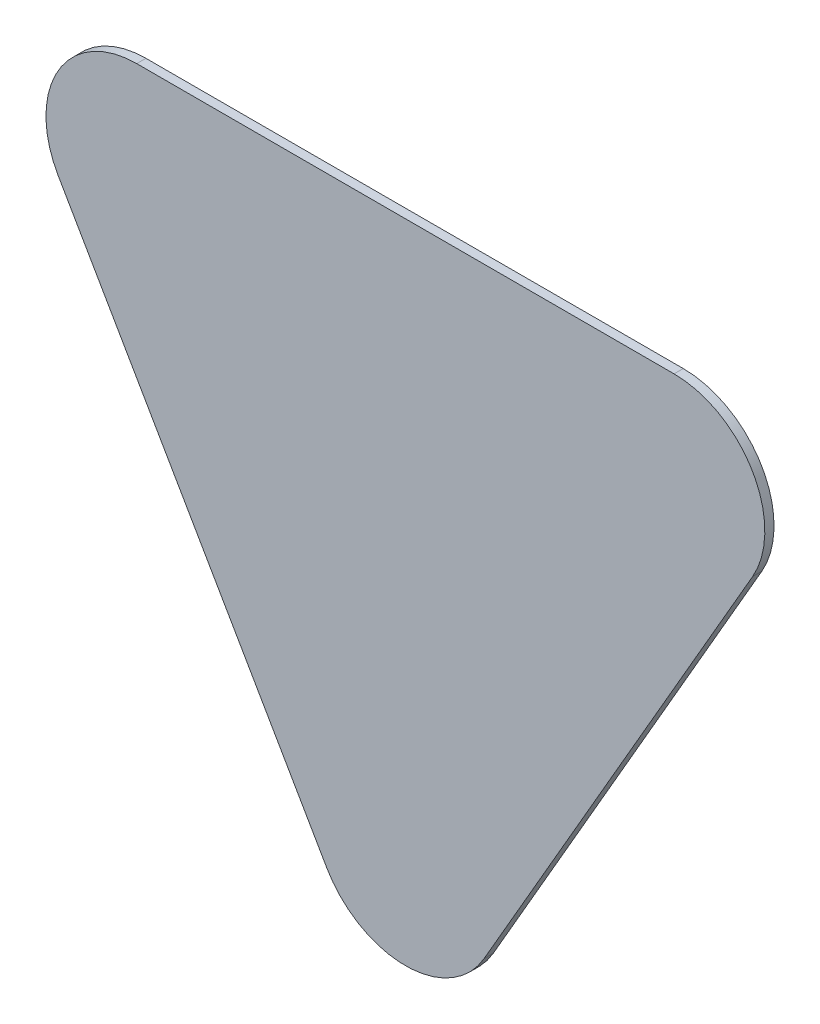
ISO-10303-21;
HEADER;
FILE_DESCRIPTION(('STEP AP214'),'2;1');
FILE_NAME('part.step','',(''),(''),'','','');
FILE_SCHEMA(('AUTOMOTIVE_DESIGN { 1 0 10303 214 1 1 1 1 }'));
ENDSEC;
DATA;
#1=APPLICATION_CONTEXT('core data for automotive mechanical design processes');
#2=APPLICATION_PROTOCOL_DEFINITION('international standard','automotive_design',2000,#1);
#3=PRODUCT_CONTEXT('',#1,'mechanical');
#4=PRODUCT('Part','Part','',(#3));
#5=PRODUCT_RELATED_PRODUCT_CATEGORY('part','',(#4));
#6=PRODUCT_DEFINITION_FORMATION('','',#4);
#7=PRODUCT_DEFINITION_CONTEXT('part definition',#1,'design');
#8=PRODUCT_DEFINITION('design','',#6,#7);
#9=PRODUCT_DEFINITION_SHAPE('','',#8);
#10=(LENGTH_UNIT() NAMED_UNIT(*) SI_UNIT(.MILLI.,.METRE.));
#11=(NAMED_UNIT(*) PLANE_ANGLE_UNIT() SI_UNIT($,.RADIAN.));
#12=(NAMED_UNIT(*) SI_UNIT($,.STERADIAN.) SOLID_ANGLE_UNIT());
#13=UNCERTAINTY_MEASURE_WITH_UNIT(LENGTH_MEASURE(1.E-05),#10,'distance_accuracy_value','');
#14=(GEOMETRIC_REPRESENTATION_CONTEXT(3) GLOBAL_UNCERTAINTY_ASSIGNED_CONTEXT((#13)) GLOBAL_UNIT_ASSIGNED_CONTEXT((#10,
#11,#12)) REPRESENTATION_CONTEXT('',''));
#15=CARTESIAN_POINT('',(0.,0.,0.));
#16=DIRECTION('',(0.,0.,1.));
#17=DIRECTION('',(1.,0.,0.));
#18=AXIS2_PLACEMENT_3D('',#15,#16,#17);
#19=CARTESIAN_POINT('',(0.,0.,0.));
#20=DIRECTION('',(0.,0.,1.));
#21=DIRECTION('',(1.,0.,0.));
#22=AXIS2_PLACEMENT_3D('',#19,#20,#21);
#23=PLANE('',#22);
#24=CARTESIAN_POINT('',(116.883451266307,281.448076157246,0.));
#25=DIRECTION('',(0.,0.,-1.));
#26=DIRECTION('',(-1.,0.,0.));
#27=AXIS2_PLACEMENT_3D('',#24,#25,#26);
#28=CIRCLE('',#27,39.5);
#29=CARTESIAN_POINT('',(151.091454715793,261.698076157246,0.));
#30=VERTEX_POINT('',#29);
#31=CARTESIAN_POINT('',(116.883451266307,320.948076157246,0.));
#32=VERTEX_POINT('',#31);
#33=EDGE_CURVE('E19',#30,#32,#28,.F.);
#34=ORIENTED_EDGE('',*,*,#33,.F.);
#35=DIRECTION('',(-0.499999999999999,-0.866025403784439,0.));
#36=VECTOR('',#35,1.);
#37=CARTESIAN_POINT('',(185.299458165278,320.948076157246,0.));
#38=LINE('',#37,#36);
#39=CARTESIAN_POINT('',(34.2080034494854,59.2500000000002,0.));
#40=VERTEX_POINT('',#39);
#41=EDGE_CURVE('E65',#30,#40,#38,.T.);
#42=ORIENTED_EDGE('',*,*,#41,.T.);
#43=CARTESIAN_POINT('',(0.,79.0000000000002,0.));
#44=DIRECTION('',(0.,0.,-1.));
#45=DIRECTION('',(-1.,0.,0.));
#46=AXIS2_PLACEMENT_3D('',#43,#44,#45);
#47=CIRCLE('',#46,39.5);
#48=CARTESIAN_POINT('',(-34.2080034494854,59.2500000000002,0.));
#49=VERTEX_POINT('',#48);
#50=EDGE_CURVE('E104',#49,#40,#47,.F.);
#51=ORIENTED_EDGE('',*,*,#50,.F.);
#52=DIRECTION('',(-0.5,0.866025403784439,0.));
#53=VECTOR('',#52,1.);
#54=CARTESIAN_POINT('',(-185.299458165278,320.948076157246,0.));
#55=LINE('',#54,#53);
#56=CARTESIAN_POINT('',(-151.091454715793,261.698076157246,0.));
#57=VERTEX_POINT('',#56);
#58=EDGE_CURVE('E96',#49,#57,#55,.T.);
#59=ORIENTED_EDGE('',*,*,#58,.T.);
#60=CARTESIAN_POINT('',(-116.883451266308,281.448076157246,0.));
#61=DIRECTION('',(0.,0.,-1.));
#62=DIRECTION('',(-1.,0.,0.));
#63=AXIS2_PLACEMENT_3D('',#60,#61,#62);
#64=CIRCLE('',#63,39.5);
#65=CARTESIAN_POINT('',(-116.883451266308,320.948076157246,0.));
#66=VERTEX_POINT('',#65);
#67=EDGE_CURVE('E74',#66,#57,#64,.F.);
#68=ORIENTED_EDGE('',*,*,#67,.F.);
#69=DIRECTION('',(1.,0.,0.));
#70=VECTOR('',#69,1.);
#71=CARTESIAN_POINT('',(185.299458165278,320.948076157246,0.));
#72=LINE('',#71,#70);
#73=EDGE_CURVE('E70',#66,#32,#72,.T.);
#74=ORIENTED_EDGE('',*,*,#73,.T.);
#75=EDGE_LOOP('',(#34,#42,#51,#59,#68,#74));
#76=FACE_BOUND('',#75,.T.);
#77=ADVANCED_FACE('F16',(#76),#23,.F.);
#78=CARTESIAN_POINT('',(185.299458165278,320.948076157246,4.));
#79=DIRECTION('',(-0.866025403784439,0.499999999999999,0.));
#80=DIRECTION('',(-0.499999999999999,-0.866025403784439,0.));
#81=AXIS2_PLACEMENT_3D('',#78,#79,#80);
#82=PLANE('',#81);
#83=DIRECTION('',(0.,0.,-1.));
#84=VECTOR('',#83,1.);
#85=CARTESIAN_POINT('',(151.091454715793,261.698076157246,4.));
#86=LINE('',#85,#84);
#87=CARTESIAN_POINT('',(151.091454715793,261.698076157246,4.));
#88=VERTEX_POINT('',#87);
#89=EDGE_CURVE('E84',#88,#30,#86,.T.);
#90=ORIENTED_EDGE('',*,*,#89,.F.);
#91=DIRECTION('',(0.499999999999999,0.866025403784439,0.));
#92=VECTOR('',#91,1.);
#93=CARTESIAN_POINT('',(34.2080034494854,59.2500000000002,4.));
#94=LINE('',#93,#92);
#95=CARTESIAN_POINT('',(34.2080034494854,59.2500000000002,4.));
#96=VERTEX_POINT('',#95);
#97=EDGE_CURVE('E103',#96,#88,#94,.T.);
#98=ORIENTED_EDGE('',*,*,#97,.F.);
#99=DIRECTION('',(0.,0.,-1.));
#100=VECTOR('',#99,1.);
#101=CARTESIAN_POINT('',(34.2080034494854,59.2500000000003,4.));
#102=LINE('',#101,#100);
#103=EDGE_CURVE('E106',#40,#96,#102,.F.);
#104=ORIENTED_EDGE('',*,*,#103,.F.);
#105=ORIENTED_EDGE('',*,*,#41,.F.);
#106=EDGE_LOOP('',(#90,#98,#104,#105));
#107=FACE_BOUND('',#106,.T.);
#108=ADVANCED_FACE('F124',(#107),#82,.F.);
#109=CARTESIAN_POINT('',(116.883451266307,281.448076157246,4.));
#110=DIRECTION('',(0.,0.,-1.));
#111=DIRECTION('',(-1.,0.,0.));
#112=AXIS2_PLACEMENT_3D('',#109,#110,#111);
#113=CYLINDRICAL_SURFACE('',#112,39.5);
#114=ORIENTED_EDGE('',*,*,#33,.T.);
#115=DIRECTION('',(0.,0.,1.));
#116=VECTOR('',#115,1.);
#117=CARTESIAN_POINT('',(116.883451266307,320.948076157246,4.));
#118=LINE('',#117,#116);
#119=CARTESIAN_POINT('',(116.883451266307,320.948076157246,4.));
#120=VERTEX_POINT('',#119);
#121=EDGE_CURVE('E78',#32,#120,#118,.T.);
#122=ORIENTED_EDGE('',*,*,#121,.T.);
#123=CARTESIAN_POINT('',(116.883451266307,281.448076157246,4.));
#124=DIRECTION('',(0.,0.,-1.));
#125=DIRECTION('',(-1.,0.,0.));
#126=AXIS2_PLACEMENT_3D('',#123,#124,#125);
#127=CIRCLE('',#126,39.5);
#128=EDGE_CURVE('E101',#88,#120,#127,.F.);
#129=ORIENTED_EDGE('',*,*,#128,.F.);
#130=ORIENTED_EDGE('',*,*,#89,.T.);
#131=EDGE_LOOP('',(#114,#122,#129,#130));
#132=FACE_BOUND('',#131,.T.);
#133=ADVANCED_FACE('F81',(#132),#113,.T.);
#134=CARTESIAN_POINT('',(185.299458165278,320.948076157246,4.));
#135=DIRECTION('',(0.,-1.,0.));
#136=DIRECTION('',(1.,0.,0.));
#137=AXIS2_PLACEMENT_3D('',#134,#135,#136);
#138=PLANE('',#137);
#139=ORIENTED_EDGE('',*,*,#121,.F.);
#140=ORIENTED_EDGE('',*,*,#73,.F.);
#141=DIRECTION('',(0.,0.,-1.));
#142=VECTOR('',#141,1.);
#143=CARTESIAN_POINT('',(-116.883451266308,320.948076157246,4.));
#144=LINE('',#143,#142);
#145=CARTESIAN_POINT('',(-116.883451266308,320.948076157246,4.));
#146=VERTEX_POINT('',#145);
#147=EDGE_CURVE('E89',#146,#66,#144,.T.);
#148=ORIENTED_EDGE('',*,*,#147,.F.);
#149=DIRECTION('',(1.,0.,0.));
#150=VECTOR('',#149,1.);
#151=CARTESIAN_POINT('',(0.,320.948076157246,4.));
#152=LINE('',#151,#150);
#153=EDGE_CURVE('E87',#120,#146,#152,.F.);
#154=ORIENTED_EDGE('',*,*,#153,.F.);
#155=EDGE_LOOP('',(#139,#140,#148,#154));
#156=FACE_BOUND('',#155,.T.);
#157=ADVANCED_FACE('F85',(#156),#138,.F.);
#158=CARTESIAN_POINT('',(-116.883451266308,281.448076157246,4.));
#159=DIRECTION('',(0.,0.,-1.));
#160=DIRECTION('',(-1.,0.,0.));
#161=AXIS2_PLACEMENT_3D('',#158,#159,#160);
#162=CYLINDRICAL_SURFACE('',#161,39.5);
#163=ORIENTED_EDGE('',*,*,#67,.T.);
#164=DIRECTION('',(0.,0.,1.));
#165=VECTOR('',#164,1.);
#166=CARTESIAN_POINT('',(-151.091454715793,261.698076157246,4.));
#167=LINE('',#166,#165);
#168=CARTESIAN_POINT('',(-151.091454715793,261.698076157246,4.));
#169=VERTEX_POINT('',#168);
#170=EDGE_CURVE('E97',#57,#169,#167,.T.);
#171=ORIENTED_EDGE('',*,*,#170,.T.);
#172=CARTESIAN_POINT('',(-116.883451266308,281.448076157246,4.));
#173=DIRECTION('',(0.,0.,-1.));
#174=DIRECTION('',(-1.,0.,0.));
#175=AXIS2_PLACEMENT_3D('',#172,#173,#174);
#176=CIRCLE('',#175,39.5);
#177=EDGE_CURVE('E99',#146,#169,#176,.F.);
#178=ORIENTED_EDGE('',*,*,#177,.F.);
#179=ORIENTED_EDGE('',*,*,#147,.T.);
#180=EDGE_LOOP('',(#163,#171,#178,#179));
#181=FACE_BOUND('',#180,.T.);
#182=ADVANCED_FACE('F110',(#181),#162,.T.);
#183=CARTESIAN_POINT('',(-185.299458165278,320.948076157246,4.));
#184=DIRECTION('',(0.866025403784439,0.5,0.));
#185=DIRECTION('',(-0.5,0.866025403784439,0.));
#186=AXIS2_PLACEMENT_3D('',#183,#184,#185);
#187=PLANE('',#186);
#188=ORIENTED_EDGE('',*,*,#170,.F.);
#189=ORIENTED_EDGE('',*,*,#58,.F.);
#190=DIRECTION('',(0.,0.,-1.));
#191=VECTOR('',#190,1.);
#192=CARTESIAN_POINT('',(-34.2080034494853,59.2500000000002,4.));
#193=LINE('',#192,#191);
#194=CARTESIAN_POINT('',(-34.2080034494854,59.2500000000002,4.));
#195=VERTEX_POINT('',#194);
#196=EDGE_CURVE('E34',#195,#49,#193,.T.);
#197=ORIENTED_EDGE('',*,*,#196,.F.);
#198=DIRECTION('',(0.5,-0.866025403784439,0.));
#199=VECTOR('',#198,1.);
#200=CARTESIAN_POINT('',(-151.091454715793,261.698076157246,4.));
#201=LINE('',#200,#199);
#202=EDGE_CURVE('E25',#169,#195,#201,.T.);
#203=ORIENTED_EDGE('',*,*,#202,.F.);
#204=EDGE_LOOP('',(#188,#189,#197,#203));
#205=FACE_BOUND('',#204,.T.);
#206=ADVANCED_FACE('F112',(#205),#187,.F.);
#207=CARTESIAN_POINT('',(0.,79.0000000000002,4.));
#208=DIRECTION('',(0.,0.,-1.));
#209=DIRECTION('',(-1.,0.,0.));
#210=AXIS2_PLACEMENT_3D('',#207,#208,#209);
#211=CYLINDRICAL_SURFACE('',#210,39.5);
#212=ORIENTED_EDGE('',*,*,#50,.T.);
#213=ORIENTED_EDGE('',*,*,#103,.T.);
#214=CARTESIAN_POINT('',(0.,79.0000000000002,4.));
#215=DIRECTION('',(0.,0.,-1.));
#216=DIRECTION('',(-1.,0.,0.));
#217=AXIS2_PLACEMENT_3D('',#214,#215,#216);
#218=CIRCLE('',#217,39.5);
#219=EDGE_CURVE('E11',#195,#96,#218,.F.);
#220=ORIENTED_EDGE('',*,*,#219,.F.);
#221=ORIENTED_EDGE('',*,*,#196,.T.);
#222=EDGE_LOOP('',(#212,#213,#220,#221));
#223=FACE_BOUND('',#222,.T.);
#224=ADVANCED_FACE('F126',(#223),#211,.T.);
#225=CARTESIAN_POINT('',(0.,0.,4.));
#226=DIRECTION('',(0.,0.,1.));
#227=DIRECTION('',(1.,0.,0.));
#228=AXIS2_PLACEMENT_3D('',#225,#226,#227);
#229=PLANE('',#228);
#230=ORIENTED_EDGE('',*,*,#202,.T.);
#231=ORIENTED_EDGE('',*,*,#219,.T.);
#232=ORIENTED_EDGE('',*,*,#97,.T.);
#233=ORIENTED_EDGE('',*,*,#128,.T.);
#234=ORIENTED_EDGE('',*,*,#153,.T.);
#235=ORIENTED_EDGE('',*,*,#177,.T.);
#236=EDGE_LOOP('',(#230,#231,#232,#233,#234,#235));
#237=FACE_BOUND('',#236,.T.);
#238=ADVANCED_FACE('F123',(#237),#229,.T.);
#239=CLOSED_SHELL('',(#77,#108,#133,#157,#182,#206,#224,#238));
#240=MANIFOLD_SOLID_BREP('B1',#239);
#241=ADVANCED_BREP_SHAPE_REPRESENTATION('',(#18,#240),#14);
#242=SHAPE_DEFINITION_REPRESENTATION(#9,#241);
ENDSEC;
END-ISO-10303-21;
